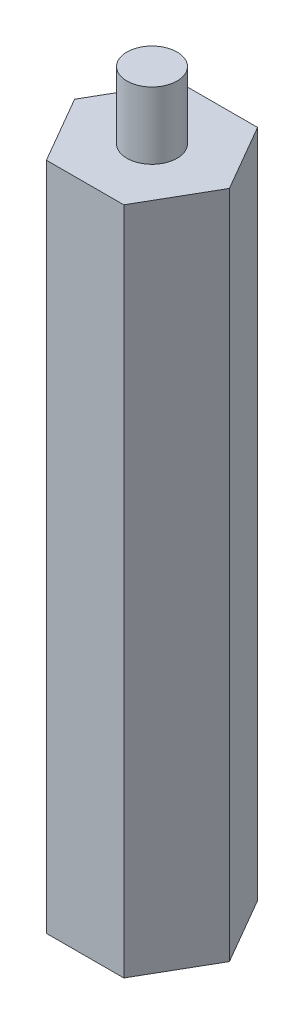
ISO-10303-21;
HEADER;
FILE_DESCRIPTION(('STEP AP214'),'2;1');
FILE_NAME('part.step','',(''),(''),'','','');
FILE_SCHEMA(('AUTOMOTIVE_DESIGN { 1 0 10303 214 1 1 1 1 }'));
ENDSEC;
DATA;
#1=APPLICATION_CONTEXT('core data for automotive mechanical design processes');
#2=APPLICATION_PROTOCOL_DEFINITION('international standard','automotive_design',2000,#1);
#3=PRODUCT_CONTEXT('',#1,'mechanical');
#4=PRODUCT('Part','Part','',(#3));
#5=PRODUCT_RELATED_PRODUCT_CATEGORY('part','',(#4));
#6=PRODUCT_DEFINITION_FORMATION('','',#4);
#7=PRODUCT_DEFINITION_CONTEXT('part definition',#1,'design');
#8=PRODUCT_DEFINITION('design','',#6,#7);
#9=PRODUCT_DEFINITION_SHAPE('','',#8);
#10=(LENGTH_UNIT() NAMED_UNIT(*) SI_UNIT(.MILLI.,.METRE.));
#11=(NAMED_UNIT(*) PLANE_ANGLE_UNIT() SI_UNIT($,.RADIAN.));
#12=(NAMED_UNIT(*) SI_UNIT($,.STERADIAN.) SOLID_ANGLE_UNIT());
#13=UNCERTAINTY_MEASURE_WITH_UNIT(LENGTH_MEASURE(1.E-05),#10,'distance_accuracy_value','');
#14=(GEOMETRIC_REPRESENTATION_CONTEXT(3) GLOBAL_UNCERTAINTY_ASSIGNED_CONTEXT((#13)) GLOBAL_UNIT_ASSIGNED_CONTEXT((#10,
#11,#12)) REPRESENTATION_CONTEXT('',''));
#15=CARTESIAN_POINT('',(0.,0.,0.));
#16=DIRECTION('',(0.,0.,1.));
#17=DIRECTION('',(1.,0.,0.));
#18=AXIS2_PLACEMENT_3D('',#15,#16,#17);
#19=CARTESIAN_POINT('',(9.23759956461125,80.,-0.00936040743649841));
#20=DIRECTION('',(-0.865518312267944,0.,0.500877281506009));
#21=DIRECTION('',(0.500877281506009,0.,0.865518312267944));
#22=AXIS2_PLACEMENT_3D('',#19,#20,#21);
#23=PLANE('',#22);
#24=DIRECTION('',(-0.500877281506009,0.,-0.865518312267944));
#25=VECTOR('',#24,1.);
#26=CARTESIAN_POINT('',(9.23759956461125,0.,-0.00936040743649841));
#27=LINE('',#26,#25);
#28=CARTESIAN_POINT('',(9.23759956461125,0.,-0.00936040743649841));
#29=VERTEX_POINT('',#28);
#30=CARTESIAN_POINT('',(4.61069343167586,0.,-8.00467609665967));
#31=VERTEX_POINT('',#30);
#32=EDGE_CURVE('E130',#29,#31,#27,.T.);
#33=ORIENTED_EDGE('',*,*,#32,.T.);
#34=DIRECTION('',(0.,-1.,0.));
#35=VECTOR('',#34,1.);
#36=CARTESIAN_POINT('',(4.61069343167586,80.,-8.00467609665967));
#37=LINE('',#36,#35);
#38=CARTESIAN_POINT('',(4.61069343167586,80.,-8.00467609665967));
#39=VERTEX_POINT('',#38);
#40=EDGE_CURVE('E42',#39,#31,#37,.T.);
#41=ORIENTED_EDGE('',*,*,#40,.F.);
#42=DIRECTION('',(-0.500877281506009,0.,-0.865518312267944));
#43=VECTOR('',#42,1.);
#44=CARTESIAN_POINT('',(9.23759956461125,80.,-0.00936040743649841));
#45=LINE('',#44,#43);
#46=CARTESIAN_POINT('',(9.23759956461125,80.,-0.00936040743649841));
#47=VERTEX_POINT('',#46);
#48=EDGE_CURVE('E147',#47,#39,#45,.T.);
#49=ORIENTED_EDGE('',*,*,#48,.F.);
#50=DIRECTION('',(0.,-1.,0.));
#51=VECTOR('',#50,1.);
#52=CARTESIAN_POINT('',(9.23759956461125,80.,-0.00936040743649841));
#53=LINE('',#52,#51);
#54=EDGE_CURVE('E126',#47,#29,#53,.T.);
#55=ORIENTED_EDGE('',*,*,#54,.T.);
#56=EDGE_LOOP('',(#33,#41,#49,#55));
#57=FACE_BOUND('',#56,.T.);
#58=ADVANCED_FACE('F39',(#57),#23,.F.);
#59=CARTESIAN_POINT('',(4.61069343167586,80.,-8.00467609665967));
#60=DIRECTION('',(0.00101329382872134,0.,0.999999486617677));
#61=DIRECTION('',(0.999999486617677,0.,-0.00101329382872134));
#62=AXIS2_PLACEMENT_3D('',#59,#60,#61);
#63=PLANE('',#62);
#64=DIRECTION('',(-0.999999486617677,0.,0.00101329382872134));
#65=VECTOR('',#64,1.);
#66=CARTESIAN_POINT('',(4.61069343167586,0.,-8.00467609665967));
#67=LINE('',#66,#65);
#68=CARTESIAN_POINT('',(-4.62690613293537,0.,-7.99531568922318));
#69=VERTEX_POINT('',#68);
#70=EDGE_CURVE('E134',#31,#69,#67,.T.);
#71=ORIENTED_EDGE('',*,*,#70,.T.);
#72=DIRECTION('',(0.,-1.,0.));
#73=VECTOR('',#72,1.);
#74=CARTESIAN_POINT('',(-4.62690613293537,80.,-7.99531568922318));
#75=LINE('',#74,#73);
#76=CARTESIAN_POINT('',(-4.62690613293537,80.,-7.99531568922318));
#77=VERTEX_POINT('',#76);
#78=EDGE_CURVE('E153',#77,#69,#75,.T.);
#79=ORIENTED_EDGE('',*,*,#78,.F.);
#80=DIRECTION('',(-0.999999486617677,0.,0.00101329382872134));
#81=VECTOR('',#80,1.);
#82=CARTESIAN_POINT('',(4.61069343167586,80.,-8.00467609665967));
#83=LINE('',#82,#81);
#84=EDGE_CURVE('E95',#39,#77,#83,.T.);
#85=ORIENTED_EDGE('',*,*,#84,.F.);
#86=ORIENTED_EDGE('',*,*,#40,.T.);
#87=EDGE_LOOP('',(#71,#79,#85,#86));
#88=FACE_BOUND('',#87,.T.);
#89=ADVANCED_FACE('F160',(#88),#63,.F.);
#90=CARTESIAN_POINT('',(-4.62690613293537,80.,-7.99531568922318));
#91=DIRECTION('',(0.866531606096666,0.,0.499122205111667));
#92=DIRECTION('',(0.499122205111667,0.,-0.866531606096666));
#93=AXIS2_PLACEMENT_3D('',#90,#91,#92);
#94=PLANE('',#93);
#95=DIRECTION('',(-0.499122205111667,0.,0.866531606096666));
#96=VECTOR('',#95,1.);
#97=CARTESIAN_POINT('',(-4.62690613293537,0.,-7.99531568922318));
#98=LINE('',#97,#96);
#99=CARTESIAN_POINT('',(-9.23759956461123,0.,0.00936040743649058));
#100=VERTEX_POINT('',#99);
#101=EDGE_CURVE('E138',#69,#100,#98,.T.);
#102=ORIENTED_EDGE('',*,*,#101,.T.);
#103=DIRECTION('',(0.,-1.,0.));
#104=VECTOR('',#103,1.);
#105=CARTESIAN_POINT('',(-9.23759956461123,80.,0.00936040743649058));
#106=LINE('',#105,#104);
#107=CARTESIAN_POINT('',(-9.23759956461123,80.,0.00936040743649058));
#108=VERTEX_POINT('',#107);
#109=EDGE_CURVE('E119',#108,#100,#106,.T.);
#110=ORIENTED_EDGE('',*,*,#109,.F.);
#111=DIRECTION('',(-0.499122205111667,0.,0.866531606096666));
#112=VECTOR('',#111,1.);
#113=CARTESIAN_POINT('',(-4.62690613293537,80.,-7.99531568922318));
#114=LINE('',#113,#112);
#115=EDGE_CURVE('E108',#77,#108,#114,.T.);
#116=ORIENTED_EDGE('',*,*,#115,.F.);
#117=ORIENTED_EDGE('',*,*,#78,.T.);
#118=EDGE_LOOP('',(#102,#110,#116,#117));
#119=FACE_BOUND('',#118,.T.);
#120=ADVANCED_FACE('F166',(#119),#94,.F.);
#121=CARTESIAN_POINT('',(-9.23759956461123,80.,0.00936040743649058));
#122=DIRECTION('',(0.865518312267944,0.,-0.500877281506009));
#123=DIRECTION('',(-0.500877281506009,0.,-0.865518312267944));
#124=AXIS2_PLACEMENT_3D('',#121,#122,#123);
#125=PLANE('',#124);
#126=DIRECTION('',(0.500877281506009,0.,0.865518312267944));
#127=VECTOR('',#126,1.);
#128=CARTESIAN_POINT('',(-9.23759956461123,0.,0.00936040743649058));
#129=LINE('',#128,#127);
#130=CARTESIAN_POINT('',(-4.61069343167583,0.,8.00467609665967));
#131=VERTEX_POINT('',#130);
#132=EDGE_CURVE('E117',#100,#131,#129,.T.);
#133=ORIENTED_EDGE('',*,*,#132,.T.);
#134=DIRECTION('',(0.,-1.,0.));
#135=VECTOR('',#134,1.);
#136=CARTESIAN_POINT('',(-4.61069343167583,80.,8.00467609665967));
#137=LINE('',#136,#135);
#138=CARTESIAN_POINT('',(-4.61069343167583,80.,8.00467609665967));
#139=VERTEX_POINT('',#138);
#140=EDGE_CURVE('E114',#139,#131,#137,.T.);
#141=ORIENTED_EDGE('',*,*,#140,.F.);
#142=DIRECTION('',(0.500877281506009,0.,0.865518312267944));
#143=VECTOR('',#142,1.);
#144=CARTESIAN_POINT('',(-9.23759956461123,80.,0.00936040743649058));
#145=LINE('',#144,#143);
#146=EDGE_CURVE('E102',#108,#139,#145,.T.);
#147=ORIENTED_EDGE('',*,*,#146,.F.);
#148=ORIENTED_EDGE('',*,*,#109,.T.);
#149=EDGE_LOOP('',(#133,#141,#147,#148));
#150=FACE_BOUND('',#149,.T.);
#151=ADVANCED_FACE('F115',(#150),#125,.F.);
#152=CARTESIAN_POINT('',(-4.61069343167583,80.,8.00467609665967));
#153=DIRECTION('',(-0.00101329382872135,0.,-0.999999486617677));
#154=DIRECTION('',(-0.999999486617677,0.,0.00101329382872135));
#155=AXIS2_PLACEMENT_3D('',#152,#153,#154);
#156=PLANE('',#155);
#157=DIRECTION('',(0.999999486617677,0.,-0.00101329382872135));
#158=VECTOR('',#157,1.);
#159=CARTESIAN_POINT('',(-4.61069343167583,0.,8.00467609665967));
#160=LINE('',#159,#158);
#161=CARTESIAN_POINT('',(4.62690613293538,0.,7.99531568922318));
#162=VERTEX_POINT('',#161);
#163=EDGE_CURVE('E80',#131,#162,#160,.T.);
#164=ORIENTED_EDGE('',*,*,#163,.T.);
#165=DIRECTION('',(0.,-1.,0.));
#166=VECTOR('',#165,1.);
#167=CARTESIAN_POINT('',(4.62690613293538,80.,7.99531568922318));
#168=LINE('',#167,#166);
#169=CARTESIAN_POINT('',(4.62690613293538,80.,7.99531568922318));
#170=VERTEX_POINT('',#169);
#171=EDGE_CURVE('E120',#170,#162,#168,.T.);
#172=ORIENTED_EDGE('',*,*,#171,.F.);
#173=DIRECTION('',(0.999999486617677,0.,-0.00101329382872135));
#174=VECTOR('',#173,1.);
#175=CARTESIAN_POINT('',(-4.61069343167583,80.,8.00467609665967));
#176=LINE('',#175,#174);
#177=EDGE_CURVE('E106',#139,#170,#176,.T.);
#178=ORIENTED_EDGE('',*,*,#177,.F.);
#179=ORIENTED_EDGE('',*,*,#140,.T.);
#180=EDGE_LOOP('',(#164,#172,#178,#179));
#181=FACE_BOUND('',#180,.T.);
#182=ADVANCED_FACE('F122',(#181),#156,.F.);
#183=CARTESIAN_POINT('',(4.62690613293538,80.,7.99531568922318));
#184=DIRECTION('',(-0.866531606096665,0.,-0.499122205111668));
#185=DIRECTION('',(-0.499122205111668,0.,0.866531606096665));
#186=AXIS2_PLACEMENT_3D('',#183,#184,#185);
#187=PLANE('',#186);
#188=DIRECTION('',(0.499122205111668,0.,-0.866531606096665));
#189=VECTOR('',#188,1.);
#190=CARTESIAN_POINT('',(4.62690613293538,0.,7.99531568922318));
#191=LINE('',#190,#189);
#192=EDGE_CURVE('E86',#162,#29,#191,.T.);
#193=ORIENTED_EDGE('',*,*,#192,.T.);
#194=ORIENTED_EDGE('',*,*,#54,.F.);
#195=DIRECTION('',(0.499122205111668,0.,-0.866531606096665));
#196=VECTOR('',#195,1.);
#197=CARTESIAN_POINT('',(4.62690613293538,80.,7.99531568922318));
#198=LINE('',#197,#196);
#199=EDGE_CURVE('E57',#170,#47,#198,.T.);
#200=ORIENTED_EDGE('',*,*,#199,.F.);
#201=ORIENTED_EDGE('',*,*,#171,.T.);
#202=EDGE_LOOP('',(#193,#194,#200,#201));
#203=FACE_BOUND('',#202,.T.);
#204=ADVANCED_FACE('F203',(#203),#187,.F.);
#205=CARTESIAN_POINT('',(0.,80.,0.));
#206=DIRECTION('',(0.,1.,0.));
#207=DIRECTION('',(0.,0.,1.));
#208=AXIS2_PLACEMENT_3D('',#205,#206,#207);
#209=PLANE('',#208);
#210=CARTESIAN_POINT('',(0.,80.,0.));
#211=DIRECTION('',(0.,1.,0.));
#212=DIRECTION('',(0.,0.,1.));
#213=AXIS2_PLACEMENT_3D('',#210,#211,#212);
#214=CIRCLE('',#213,3.);
#215=CARTESIAN_POINT('',(0.,80.,3.));
#216=VERTEX_POINT('',#215);
#217=EDGE_CURVE('E11',#216,#216,#214,.T.);
#218=ORIENTED_EDGE('',*,*,#217,.F.);
#219=EDGE_LOOP('',(#218));
#220=FACE_BOUND('',#219,.T.);
#221=ORIENTED_EDGE('',*,*,#48,.T.);
#222=ORIENTED_EDGE('',*,*,#84,.T.);
#223=ORIENTED_EDGE('',*,*,#115,.T.);
#224=ORIENTED_EDGE('',*,*,#146,.T.);
#225=ORIENTED_EDGE('',*,*,#177,.T.);
#226=ORIENTED_EDGE('',*,*,#199,.T.);
#227=EDGE_LOOP('',(#221,#222,#223,#224,#225,#226));
#228=FACE_BOUND('',#227,.T.);
#229=ADVANCED_FACE('F104',(#220,#228),#209,.T.);
#230=CARTESIAN_POINT('',(0.,0.,0.));
#231=DIRECTION('',(0.,1.,0.));
#232=DIRECTION('',(0.,0.,1.));
#233=AXIS2_PLACEMENT_3D('',#230,#231,#232);
#234=PLANE('',#233);
#235=CARTESIAN_POINT('',(0.,0.,0.));
#236=DIRECTION('',(0.,-1.,0.));
#237=DIRECTION('',(0.,0.,-1.));
#238=AXIS2_PLACEMENT_3D('',#235,#236,#237);
#239=CIRCLE('',#238,3.);
#240=CARTESIAN_POINT('',(0.,0.,-3.));
#241=VERTEX_POINT('',#240);
#242=EDGE_CURVE('E177',#241,#241,#239,.T.);
#243=ORIENTED_EDGE('',*,*,#242,.F.);
#244=EDGE_LOOP('',(#243));
#245=FACE_BOUND('',#244,.T.);
#246=ORIENTED_EDGE('',*,*,#32,.F.);
#247=ORIENTED_EDGE('',*,*,#192,.F.);
#248=ORIENTED_EDGE('',*,*,#163,.F.);
#249=ORIENTED_EDGE('',*,*,#132,.F.);
#250=ORIENTED_EDGE('',*,*,#101,.F.);
#251=ORIENTED_EDGE('',*,*,#70,.F.);
#252=EDGE_LOOP('',(#246,#247,#248,#249,#250,#251));
#253=FACE_BOUND('',#252,.T.);
#254=ADVANCED_FACE('F165',(#245,#253),#234,.F.);
#255=CARTESIAN_POINT('',(0.,88.,0.));
#256=DIRECTION('',(0.,-1.,0.));
#257=DIRECTION('',(0.,0.,-1.));
#258=AXIS2_PLACEMENT_3D('',#255,#256,#257);
#259=CYLINDRICAL_SURFACE('',#258,3.);
#260=CARTESIAN_POINT('',(0.,88.,0.));
#261=DIRECTION('',(0.,1.,0.));
#262=DIRECTION('',(0.,0.,1.));
#263=AXIS2_PLACEMENT_3D('',#260,#261,#262);
#264=CIRCLE('',#263,3.);
#265=CARTESIAN_POINT('',(0.,88.,3.));
#266=VERTEX_POINT('',#265);
#267=EDGE_CURVE('E135',#266,#266,#264,.T.);
#268=ORIENTED_EDGE('',*,*,#267,.F.);
#269=EDGE_LOOP('',(#268));
#270=FACE_BOUND('',#269,.T.);
#271=ORIENTED_EDGE('',*,*,#217,.T.);
#272=EDGE_LOOP('',(#271));
#273=FACE_BOUND('',#272,.T.);
#274=ADVANCED_FACE('F195',(#270,#273),#259,.T.);
#275=CARTESIAN_POINT('',(0.,88.,0.));
#276=DIRECTION('',(0.,1.,0.));
#277=DIRECTION('',(0.,0.,1.));
#278=AXIS2_PLACEMENT_3D('',#275,#276,#277);
#279=PLANE('',#278);
#280=ORIENTED_EDGE('',*,*,#267,.T.);
#281=EDGE_LOOP('',(#280));
#282=FACE_BOUND('',#281,.T.);
#283=ADVANCED_FACE('F190',(#282),#279,.T.);
#284=CARTESIAN_POINT('',(0.,8.,0.));
#285=DIRECTION('',(0.,-1.,0.));
#286=DIRECTION('',(0.,0.,-1.));
#287=AXIS2_PLACEMENT_3D('',#284,#285,#286);
#288=CYLINDRICAL_SURFACE('',#287,3.);
#289=CARTESIAN_POINT('',(0.,8.,0.));
#290=DIRECTION('',(0.,-1.,0.));
#291=DIRECTION('',(0.,0.,-1.));
#292=AXIS2_PLACEMENT_3D('',#289,#290,#291);
#293=CIRCLE('',#292,3.);
#294=CARTESIAN_POINT('',(0.,8.,-3.));
#295=VERTEX_POINT('',#294);
#296=EDGE_CURVE('E176',#295,#295,#293,.T.);
#297=ORIENTED_EDGE('',*,*,#296,.F.);
#298=EDGE_LOOP('',(#297));
#299=FACE_BOUND('',#298,.T.);
#300=ORIENTED_EDGE('',*,*,#242,.T.);
#301=EDGE_LOOP('',(#300));
#302=FACE_BOUND('',#301,.T.);
#303=ADVANCED_FACE('F187',(#299,#302),#288,.F.);
#304=CARTESIAN_POINT('',(0.,8.,0.));
#305=DIRECTION('',(0.,-1.,0.));
#306=DIRECTION('',(0.,0.,-1.));
#307=AXIS2_PLACEMENT_3D('',#304,#305,#306);
#308=PLANE('',#307);
#309=ORIENTED_EDGE('',*,*,#296,.T.);
#310=EDGE_LOOP('',(#309));
#311=FACE_BOUND('',#310,.T.);
#312=ADVANCED_FACE('F185',(#311),#308,.T.);
#313=CLOSED_SHELL('',(#58,#89,#120,#151,#182,#204,#229,#254,#274,#283,#303,#312));
#314=MANIFOLD_SOLID_BREP('B2',#313);
#315=ADVANCED_BREP_SHAPE_REPRESENTATION('',(#18,#314),#14);
#316=SHAPE_DEFINITION_REPRESENTATION(#9,#315);
ENDSEC;
END-ISO-10303-21;
